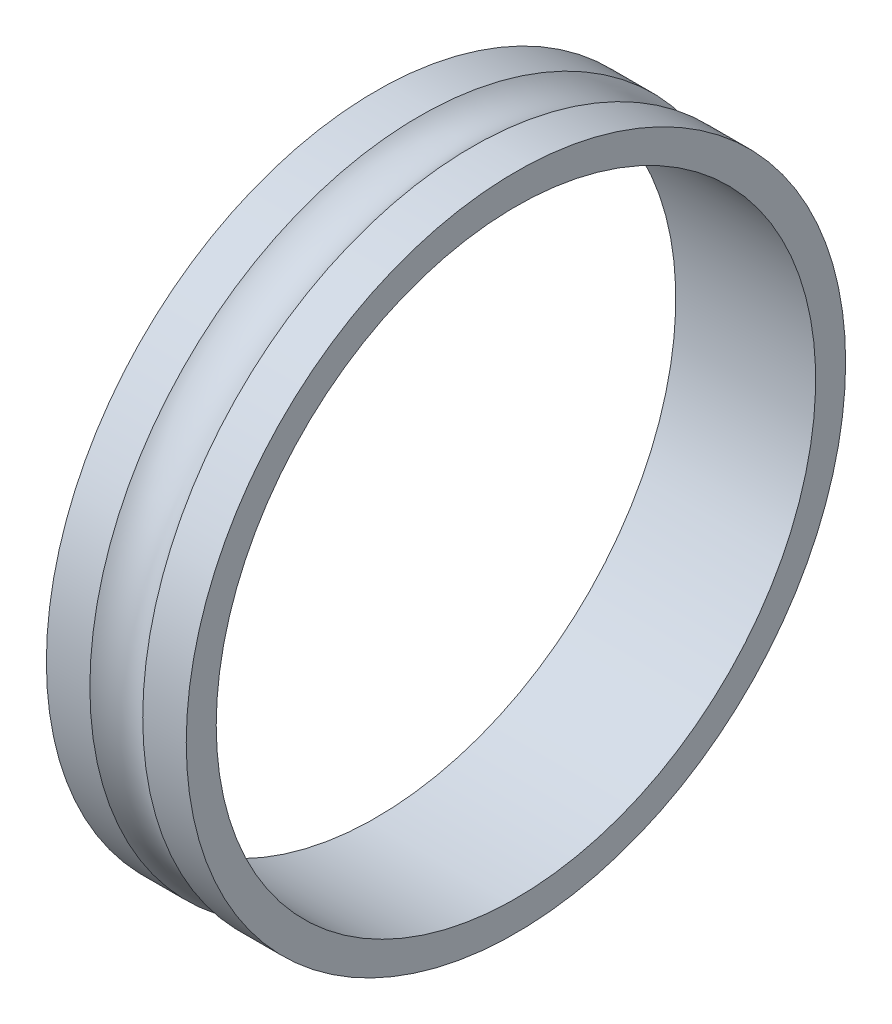
ISO-10303-21;
HEADER;
FILE_DESCRIPTION(('STEP AP214'),'2;1');
FILE_NAME('part.step','',(''),(''),'','','');
FILE_SCHEMA(('AUTOMOTIVE_DESIGN { 1 0 10303 214 1 1 1 1 }'));
ENDSEC;
DATA;
#1=APPLICATION_CONTEXT('core data for automotive mechanical design processes');
#2=APPLICATION_PROTOCOL_DEFINITION('international standard','automotive_design',2000,#1);
#3=PRODUCT_CONTEXT('',#1,'mechanical');
#4=PRODUCT('Part','Part','',(#3));
#5=PRODUCT_RELATED_PRODUCT_CATEGORY('part','',(#4));
#6=PRODUCT_DEFINITION_FORMATION('','',#4);
#7=PRODUCT_DEFINITION_CONTEXT('part definition',#1,'design');
#8=PRODUCT_DEFINITION('design','',#6,#7);
#9=PRODUCT_DEFINITION_SHAPE('','',#8);
#10=(LENGTH_UNIT() NAMED_UNIT(*) SI_UNIT(.MILLI.,.METRE.));
#11=(NAMED_UNIT(*) PLANE_ANGLE_UNIT() SI_UNIT($,.RADIAN.));
#12=(NAMED_UNIT(*) SI_UNIT($,.STERADIAN.) SOLID_ANGLE_UNIT());
#13=UNCERTAINTY_MEASURE_WITH_UNIT(LENGTH_MEASURE(1.E-05),#10,'distance_accuracy_value','');
#14=(GEOMETRIC_REPRESENTATION_CONTEXT(3) GLOBAL_UNCERTAINTY_ASSIGNED_CONTEXT((#13)) GLOBAL_UNIT_ASSIGNED_CONTEXT((#10,
#11,#12)) REPRESENTATION_CONTEXT('',''));
#15=CARTESIAN_POINT('',(0.,0.,0.));
#16=DIRECTION('',(0.,0.,1.));
#17=DIRECTION('',(1.,0.,0.));
#18=AXIS2_PLACEMENT_3D('',#15,#16,#17);
#19=CARTESIAN_POINT('',(-3.5,0.,-3.));
#20=DIRECTION('',(-1.,0.,0.));
#21=DIRECTION('',(0.,0.,1.));
#22=AXIS2_PLACEMENT_3D('',#19,#20,#21);
#23=PLANE('',#22);
#24=CARTESIAN_POINT('',(-3.5,0.,-18.));
#25=DIRECTION('',(-1.,0.,0.));
#26=DIRECTION('',(0.,0.,1.));
#27=AXIS2_PLACEMENT_3D('',#24,#25,#26);
#28=CIRCLE('',#27,16.5);
#29=CARTESIAN_POINT('',(-3.5,0.,-1.5));
#30=VERTEX_POINT('',#29);
#31=EDGE_CURVE('E11',#30,#30,#28,.T.);
#32=ORIENTED_EDGE('',*,*,#31,.T.);
#33=EDGE_LOOP('',(#32));
#34=FACE_BOUND('',#33,.T.);
#35=CARTESIAN_POINT('',(-3.5,0.,-18.));
#36=DIRECTION('',(-1.,0.,0.));
#37=DIRECTION('',(0.,0.,1.));
#38=AXIS2_PLACEMENT_3D('',#35,#36,#37);
#39=CIRCLE('',#38,15.);
#40=CARTESIAN_POINT('',(-3.5,0.,-3.));
#41=VERTEX_POINT('',#40);
#42=EDGE_CURVE('E59',#41,#41,#39,.T.);
#43=ORIENTED_EDGE('',*,*,#42,.F.);
#44=EDGE_LOOP('',(#43));
#45=FACE_BOUND('',#44,.T.);
#46=ADVANCED_FACE('F37',(#34,#45),#23,.T.);
#47=CARTESIAN_POINT('',(0.,0.,-18.));
#48=DIRECTION('',(-1.,0.,0.));
#49=DIRECTION('',(0.,0.,1.));
#50=AXIS2_PLACEMENT_3D('',#47,#48,#49);
#51=CYLINDRICAL_SURFACE('',#50,16.5);
#52=CARTESIAN_POINT('',(-1.32287565553229,0.,-18.));
#53=DIRECTION('',(-1.,0.,0.));
#54=DIRECTION('',(0.,0.,1.));
#55=AXIS2_PLACEMENT_3D('',#52,#53,#54);
#56=CIRCLE('',#55,16.5);
#57=CARTESIAN_POINT('',(-1.32287565553229,0.,-1.5));
#58=VERTEX_POINT('',#57);
#59=EDGE_CURVE('E43',#58,#58,#56,.T.);
#60=ORIENTED_EDGE('',*,*,#59,.T.);
#61=EDGE_LOOP('',(#60));
#62=FACE_BOUND('',#61,.T.);
#63=ORIENTED_EDGE('',*,*,#31,.F.);
#64=EDGE_LOOP('',(#63));
#65=FACE_BOUND('',#64,.T.);
#66=ADVANCED_FACE('F67',(#62,#65),#51,.T.);
#67=CARTESIAN_POINT('',(0.,0.,-18.));
#68=DIRECTION('',(-1.,0.,0.));
#69=DIRECTION('',(0.,0.,1.));
#70=AXIS2_PLACEMENT_3D('',#67,#68,#69);
#71=TOROIDAL_SURFACE('',#70,18.,2.);
#72=CARTESIAN_POINT('',(1.32287565553229,0.,-18.));
#73=DIRECTION('',(-1.,0.,0.));
#74=DIRECTION('',(0.,0.,1.));
#75=AXIS2_PLACEMENT_3D('',#72,#73,#74);
#76=CIRCLE('',#75,16.5);
#77=CARTESIAN_POINT('',(1.32287565553229,0.,-1.5));
#78=VERTEX_POINT('',#77);
#79=EDGE_CURVE('E47',#78,#78,#76,.T.);
#80=ORIENTED_EDGE('',*,*,#79,.T.);
#81=EDGE_LOOP('',(#80));
#82=FACE_BOUND('',#81,.T.);
#83=ORIENTED_EDGE('',*,*,#59,.F.);
#84=EDGE_LOOP('',(#83));
#85=FACE_BOUND('',#84,.T.);
#86=ADVANCED_FACE('F71',(#82,#85),#71,.F.);
#87=CARTESIAN_POINT('',(0.,0.,-18.));
#88=DIRECTION('',(-1.,0.,0.));
#89=DIRECTION('',(0.,0.,1.));
#90=AXIS2_PLACEMENT_3D('',#87,#88,#89);
#91=CYLINDRICAL_SURFACE('',#90,16.5);
#92=CARTESIAN_POINT('',(3.5,0.,-18.));
#93=DIRECTION('',(-1.,0.,0.));
#94=DIRECTION('',(0.,0.,1.));
#95=AXIS2_PLACEMENT_3D('',#92,#93,#94);
#96=CIRCLE('',#95,16.5);
#97=CARTESIAN_POINT('',(3.5,0.,-1.5));
#98=VERTEX_POINT('',#97);
#99=EDGE_CURVE('E51',#98,#98,#96,.T.);
#100=ORIENTED_EDGE('',*,*,#99,.T.);
#101=EDGE_LOOP('',(#100));
#102=FACE_BOUND('',#101,.T.);
#103=ORIENTED_EDGE('',*,*,#79,.F.);
#104=EDGE_LOOP('',(#103));
#105=FACE_BOUND('',#104,.T.);
#106=ADVANCED_FACE('F75',(#102,#105),#91,.T.);
#107=CARTESIAN_POINT('',(3.5,0.,-3.));
#108=DIRECTION('',(1.,0.,0.));
#109=DIRECTION('',(0.,0.,-1.));
#110=AXIS2_PLACEMENT_3D('',#107,#108,#109);
#111=PLANE('',#110);
#112=CARTESIAN_POINT('',(3.5,0.,-18.));
#113=DIRECTION('',(-1.,0.,0.));
#114=DIRECTION('',(0.,0.,1.));
#115=AXIS2_PLACEMENT_3D('',#112,#113,#114);
#116=CIRCLE('',#115,15.);
#117=CARTESIAN_POINT('',(3.5,0.,-3.));
#118=VERTEX_POINT('',#117);
#119=EDGE_CURVE('E56',#118,#118,#116,.T.);
#120=ORIENTED_EDGE('',*,*,#119,.T.);
#121=EDGE_LOOP('',(#120));
#122=FACE_BOUND('',#121,.T.);
#123=ORIENTED_EDGE('',*,*,#99,.F.);
#124=EDGE_LOOP('',(#123));
#125=FACE_BOUND('',#124,.T.);
#126=ADVANCED_FACE('F82',(#122,#125),#111,.T.);
#127=CARTESIAN_POINT('',(0.,0.,-18.));
#128=DIRECTION('',(-1.,0.,0.));
#129=DIRECTION('',(0.,0.,1.));
#130=AXIS2_PLACEMENT_3D('',#127,#128,#129);
#131=CYLINDRICAL_SURFACE('',#130,15.);
#132=ORIENTED_EDGE('',*,*,#42,.T.);
#133=EDGE_LOOP('',(#132));
#134=FACE_BOUND('',#133,.T.);
#135=ORIENTED_EDGE('',*,*,#119,.F.);
#136=EDGE_LOOP('',(#135));
#137=FACE_BOUND('',#136,.T.);
#138=ADVANCED_FACE('F63',(#134,#137),#131,.F.);
#139=CLOSED_SHELL('',(#46,#66,#86,#106,#126,#138));
#140=MANIFOLD_SOLID_BREP('B2',#139);
#141=ADVANCED_BREP_SHAPE_REPRESENTATION('',(#18,#140),#14);
#142=SHAPE_DEFINITION_REPRESENTATION(#9,#141);
ENDSEC;
END-ISO-10303-21;
